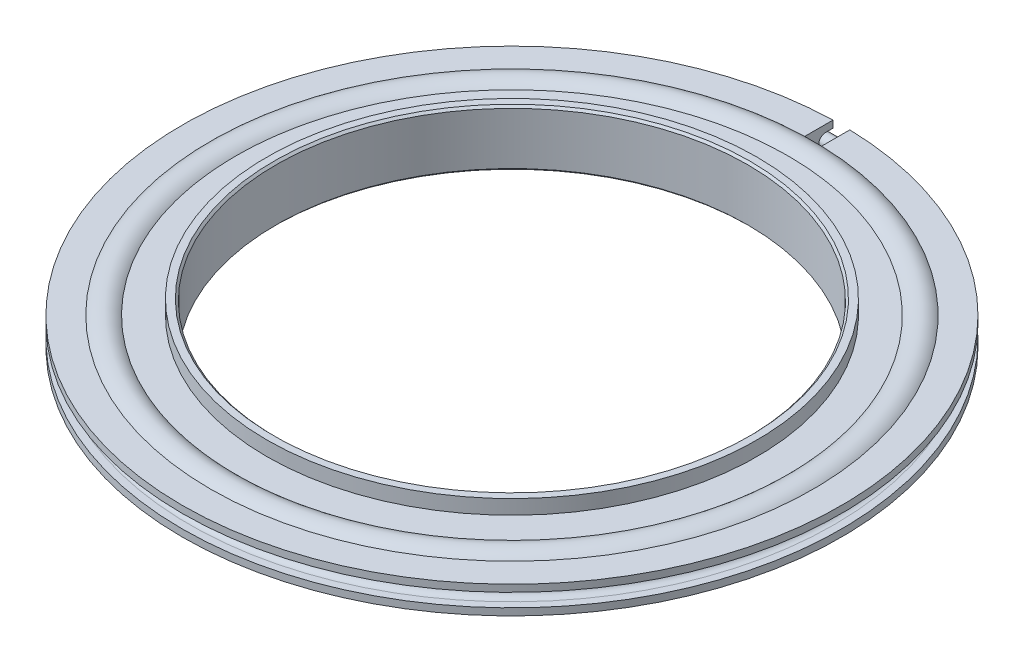
ISO-10303-21;
HEADER;
FILE_DESCRIPTION(('STEP AP214'),'2;1');
FILE_NAME('part.step','',(''),(''),'','','');
FILE_SCHEMA(('AUTOMOTIVE_DESIGN { 1 0 10303 214 1 1 1 1 }'));
ENDSEC;
DATA;
#1=APPLICATION_CONTEXT('core data for automotive mechanical design processes');
#2=APPLICATION_PROTOCOL_DEFINITION('international standard','automotive_design',2000,#1);
#3=PRODUCT_CONTEXT('',#1,'mechanical');
#4=PRODUCT('Part','Part','',(#3));
#5=PRODUCT_RELATED_PRODUCT_CATEGORY('part','',(#4));
#6=PRODUCT_DEFINITION_FORMATION('','',#4);
#7=PRODUCT_DEFINITION_CONTEXT('part definition',#1,'design');
#8=PRODUCT_DEFINITION('design','',#6,#7);
#9=PRODUCT_DEFINITION_SHAPE('','',#8);
#10=(LENGTH_UNIT() NAMED_UNIT(*) SI_UNIT(.MILLI.,.METRE.));
#11=(NAMED_UNIT(*) PLANE_ANGLE_UNIT() SI_UNIT($,.RADIAN.));
#12=(NAMED_UNIT(*) SI_UNIT($,.STERADIAN.) SOLID_ANGLE_UNIT());
#13=UNCERTAINTY_MEASURE_WITH_UNIT(LENGTH_MEASURE(1.E-05),#10,'distance_accuracy_value','');
#14=(GEOMETRIC_REPRESENTATION_CONTEXT(3) GLOBAL_UNCERTAINTY_ASSIGNED_CONTEXT((#13)) GLOBAL_UNIT_ASSIGNED_CONTEXT((#10,
#11,#12)) REPRESENTATION_CONTEXT('',''));
#15=CARTESIAN_POINT('',(0.,0.,0.));
#16=DIRECTION('',(0.,0.,1.));
#17=DIRECTION('',(1.,0.,0.));
#18=AXIS2_PLACEMENT_3D('',#15,#16,#17);
#19=CARTESIAN_POINT('',(0.,0.,0.));
#20=DIRECTION('',(0.,1.,0.));
#21=DIRECTION('',(0.,0.,1.));
#22=AXIS2_PLACEMENT_3D('',#19,#20,#21);
#23=TOROIDAL_SURFACE('',#22,45.75,0.700000000000014);
#24=CARTESIAN_POINT('',(11.0679267236848,0.,-44.3910294771269));
#25=DIRECTION('',(-0.970295726275997,0.,-0.241921895599668));
#26=DIRECTION('',(-0.241921895599668,0.,0.970295726275997));
#27=AXIS2_PLACEMENT_3D('',#24,#25,#26);
#28=CIRCLE('',#27,0.700000000000014);
#29=CARTESIAN_POINT('',(11.2372720506046,0.,-45.0702364855201));
#30=VERTEX_POINT('',#29);
#31=EDGE_CURVE('E70',#30,#30,#28,.T.);
#32=CARTESIAN_POINT('',(-11.0679267236848,0.,-44.3910294771268));
#33=DIRECTION('',(-0.970295726275996,0.,0.241921895599669));
#34=DIRECTION('',(0.241921895599669,0.,0.970295726275996));
#35=AXIS2_PLACEMENT_3D('',#32,#33,#34);
#36=CIRCLE('',#35,0.700000000000014);
#37=CARTESIAN_POINT('',(-11.2372720506046,0.,-45.0702364855201));
#38=VERTEX_POINT('',#37);
#39=EDGE_CURVE('E78',#38,#38,#36,.T.);
#40=CARTESIAN_POINT('',(0.,0.,0.));
#41=DIRECTION('',(0.,1.,0.));
#42=DIRECTION('',(0.,0.,1.));
#43=AXIS2_PLACEMENT_3D('',#40,#41,#42);
#44=CIRCLE('',#43,46.45);
#45=EDGE_CURVE('',#30,#38,#44,.T.);
#46=ORIENTED_EDGE('',*,*,#31,.F.);
#47=ORIENTED_EDGE('',*,*,#39,.T.);
#48=ORIENTED_EDGE('',*,*,#45,.T.);
#49=ORIENTED_EDGE('',*,*,#45,.F.);
#50=EDGE_LOOP('',(#46,#48,#47,#49));
#51=FACE_BOUND('',#50,.T.);
#52=ADVANCED_FACE('F63',(#51),#23,.F.);
#53=CARTESIAN_POINT('',(0.,0.,0.));
#54=DIRECTION('',(0.,1.,0.));
#55=DIRECTION('',(0.,0.,1.));
#56=AXIS2_PLACEMENT_3D('',#53,#54,#55);
#57=TOROIDAL_SURFACE('',#56,45.75,0.899999999999993);
#58=CARTESIAN_POINT('',(11.0679267236848,0.,-44.3910294771269));
#59=DIRECTION('',(-0.970295726275997,0.,-0.241921895599668));
#60=DIRECTION('',(-0.241921895599668,0.,0.970295726275997));
#61=AXIS2_PLACEMENT_3D('',#58,#59,#60);
#62=CIRCLE('',#61,0.899999999999993);
#63=CARTESIAN_POINT('',(11.2856564297245,0.,-45.2642956307753));
#64=VERTEX_POINT('',#63);
#65=EDGE_CURVE('E11',#64,#64,#62,.T.);
#66=CARTESIAN_POINT('',(-11.0679267236848,0.,-44.3910294771268));
#67=DIRECTION('',(-0.970295726275996,0.,0.241921895599669));
#68=DIRECTION('',(0.241921895599669,0.,0.970295726275996));
#69=AXIS2_PLACEMENT_3D('',#66,#67,#68);
#70=CIRCLE('',#69,0.899999999999993);
#71=CARTESIAN_POINT('',(-11.2856564297245,0.,-45.2642956307752));
#72=VERTEX_POINT('',#71);
#73=EDGE_CURVE('E74',#72,#72,#70,.T.);
#74=CARTESIAN_POINT('',(0.,0.,0.));
#75=DIRECTION('',(0.,1.,0.));
#76=DIRECTION('',(0.,0.,1.));
#77=AXIS2_PLACEMENT_3D('',#74,#75,#76);
#78=CIRCLE('',#77,46.65);
#79=EDGE_CURVE('',#64,#72,#78,.T.);
#80=ORIENTED_EDGE('',*,*,#65,.T.);
#81=ORIENTED_EDGE('',*,*,#73,.F.);
#82=ORIENTED_EDGE('',*,*,#79,.T.);
#83=ORIENTED_EDGE('',*,*,#79,.F.);
#84=EDGE_LOOP('',(#80,#82,#81,#83));
#85=FACE_BOUND('',#84,.T.);
#86=ADVANCED_FACE('F65',(#85),#57,.T.);
#87=CARTESIAN_POINT('',(11.0679267236848,0.,-44.3910294771269));
#88=DIRECTION('',(-0.970295726275997,0.,-0.241921895599668));
#89=DIRECTION('',(-0.241921895599668,0.,0.970295726275997));
#90=AXIS2_PLACEMENT_3D('',#87,#88,#89);
#91=PLANE('',#90);
#92=ORIENTED_EDGE('',*,*,#31,.T.);
#93=EDGE_LOOP('',(#92));
#94=FACE_BOUND('',#93,.T.);
#95=ORIENTED_EDGE('',*,*,#65,.F.);
#96=EDGE_LOOP('',(#95));
#97=FACE_BOUND('',#96,.T.);
#98=ADVANCED_FACE('F88',(#94,#97),#91,.F.);
#99=CARTESIAN_POINT('',(-11.0679267236848,0.,-44.3910294771268));
#100=DIRECTION('',(-0.970295726275996,0.,0.241921895599669));
#101=DIRECTION('',(0.241921895599669,0.,0.970295726275996));
#102=AXIS2_PLACEMENT_3D('',#99,#100,#101);
#103=PLANE('',#102);
#104=ORIENTED_EDGE('',*,*,#39,.F.);
#105=EDGE_LOOP('',(#104));
#106=FACE_BOUND('',#105,.T.);
#107=ORIENTED_EDGE('',*,*,#73,.T.);
#108=EDGE_LOOP('',(#107));
#109=FACE_BOUND('',#108,.T.);
#110=ADVANCED_FACE('F85',(#106,#109),#103,.T.);
#111=CLOSED_SHELL('',(#52,#86,#98,#110));
#112=MANIFOLD_SOLID_BREP('B2',#111);
#113=CARTESIAN_POINT('',(0.,11.9009557377661,0.));
#114=DIRECTION('',(0.,1.,0.));
#115=DIRECTION('',(0.,0.,1.));
#116=AXIS2_PLACEMENT_3D('',#113,#114,#115);
#117=CYLINDRICAL_SURFACE('',#116,46.8);
#118=DIRECTION('',(0.,-1.,0.));
#119=VECTOR('',#118,1.);
#120=CARTESIAN_POINT('',(1.2,11.9009557377661,-46.784612855083));
#121=LINE('',#120,#119);
#122=CARTESIAN_POINT('',(1.2,-0.95,-46.784612855083));
#123=VERTEX_POINT('',#122);
#124=CARTESIAN_POINT('',(1.2,-1.95,-46.784612855083));
#125=VERTEX_POINT('',#124);
#126=EDGE_CURVE('E244',#123,#125,#121,.T.);
#127=ORIENTED_EDGE('',*,*,#126,.F.);
#128=CARTESIAN_POINT('',(0.,-0.95,0.));
#129=DIRECTION('',(0.,1.,0.));
#130=DIRECTION('',(0.,0.,1.));
#131=AXIS2_PLACEMENT_3D('',#128,#129,#130);
#132=CIRCLE('',#131,46.8);
#133=CARTESIAN_POINT('',(-1.2,-0.95,-46.784612855083));
#134=VERTEX_POINT('',#133);
#135=EDGE_CURVE('E228',#134,#123,#132,.T.);
#136=ORIENTED_EDGE('',*,*,#135,.F.);
#137=DIRECTION('',(0.,1.,0.));
#138=VECTOR('',#137,1.);
#139=CARTESIAN_POINT('',(-1.2,11.9009557377661,-46.784612855083));
#140=LINE('',#139,#138);
#141=CARTESIAN_POINT('',(-1.2,-1.95,-46.784612855083));
#142=VERTEX_POINT('',#141);
#143=EDGE_CURVE('E290',#142,#134,#140,.T.);
#144=ORIENTED_EDGE('',*,*,#143,.F.);
#145=CARTESIAN_POINT('',(0.,-1.95,0.));
#146=DIRECTION('',(0.,1.,0.));
#147=DIRECTION('',(0.,0.,1.));
#148=AXIS2_PLACEMENT_3D('',#145,#146,#147);
#149=CIRCLE('',#148,46.8);
#150=EDGE_CURVE('E146',#142,#125,#149,.T.);
#151=ORIENTED_EDGE('',*,*,#150,.T.);
#152=EDGE_LOOP('',(#127,#136,#144,#151));
#153=FACE_BOUND('',#152,.T.);
#154=ADVANCED_FACE('F135',(#153),#117,.T.);
#155=CARTESIAN_POINT('',(-1.2,0.95,-46.784612855083));
#156=VERTEX_POINT('',#155);
#157=CARTESIAN_POINT('',(-1.2,1.95,-46.784612855083));
#158=VERTEX_POINT('',#157);
#159=EDGE_CURVE('E262',#156,#158,#140,.T.);
#160=ORIENTED_EDGE('',*,*,#159,.F.);
#161=CARTESIAN_POINT('',(0.,0.95,0.));
#162=DIRECTION('',(0.,1.,0.));
#163=DIRECTION('',(0.,0.,1.));
#164=AXIS2_PLACEMENT_3D('',#161,#162,#163);
#165=CIRCLE('',#164,46.8);
#166=CARTESIAN_POINT('',(1.2,0.95,-46.784612855083));
#167=VERTEX_POINT('',#166);
#168=EDGE_CURVE('E240',#156,#167,#165,.T.);
#169=ORIENTED_EDGE('',*,*,#168,.T.);
#170=CARTESIAN_POINT('',(1.2,1.95,-46.784612855083));
#171=VERTEX_POINT('',#170);
#172=EDGE_CURVE('E253',#171,#167,#121,.T.);
#173=ORIENTED_EDGE('',*,*,#172,.F.);
#174=CARTESIAN_POINT('',(0.,1.95,0.));
#175=DIRECTION('',(0.,1.,0.));
#176=DIRECTION('',(0.,0.,1.));
#177=AXIS2_PLACEMENT_3D('',#174,#175,#176);
#178=CIRCLE('',#177,46.8);
#179=EDGE_CURVE('E294',#158,#171,#178,.T.);
#180=ORIENTED_EDGE('',*,*,#179,.F.);
#181=EDGE_LOOP('',(#160,#169,#173,#180));
#182=FACE_BOUND('',#181,.T.);
#183=ADVANCED_FACE('F435',(#182),#117,.T.);
#184=CARTESIAN_POINT('',(-1.2,-4.,-49.));
#185=DIRECTION('',(-1.,0.,0.));
#186=DIRECTION('',(0.,1.,0.));
#187=AXIS2_PLACEMENT_3D('',#184,#185,#186);
#188=PLANE('',#187);
#189=DIRECTION('',(0.,0.,1.));
#190=VECTOR('',#189,1.);
#191=CARTESIAN_POINT('',(-1.2,-0.95,0.));
#192=LINE('',#191,#190);
#193=CARTESIAN_POINT('',(-1.2,-0.950000000000003,-45.7342595873159));
#194=VERTEX_POINT('',#193);
#195=EDGE_CURVE('E235',#134,#194,#192,.T.);
#196=ORIENTED_EDGE('',*,*,#195,.T.);
#197=CARTESIAN_POINT('',(-1.2,-0.950000000000007,-45.7342595873159));
#198=CARTESIAN_POINT('',(-1.2,-0.95004532600479,-45.6807835862706));
#199=CARTESIAN_POINT('',(-1.2,-0.94549052715475,-45.6273210432147));
#200=CARTESIAN_POINT('',(-1.2,-0.927514539490264,-45.5219452192249));
#201=CARTESIAN_POINT('',(-1.2,-0.914099687078438,-45.4700308587953));
#202=CARTESIAN_POINT('',(-1.2,-0.878727986361987,-45.3691686045336));
#203=CARTESIAN_POINT('',(-1.2,-0.856766991021886,-45.3202221642397));
#204=CARTESIAN_POINT('',(-1.2,-0.804946348114225,-45.2267227979042));
#205=CARTESIAN_POINT('',(-1.2,-0.775088624932405,-45.1821688050756));
#206=CARTESIAN_POINT('',(-1.2,-0.7083225603589,-45.098716419276));
#207=CARTESIAN_POINT('',(-1.2,-0.671415758236421,-45.059816794851));
#208=CARTESIAN_POINT('',(-1.2,-0.591577938839479,-44.9887531068965));
#209=CARTESIAN_POINT('',(-1.2,-0.548644628954462,-44.9565916183562));
#210=CARTESIAN_POINT('',(-1.2,-0.457987119674033,-44.8999373842834));
#211=CARTESIAN_POINT('',(-1.2,-0.410262626271292,-44.8754451097467));
#212=CARTESIAN_POINT('',(-1.2,-0.311415541954127,-44.8348507871987));
#213=CARTESIAN_POINT('',(-1.2,-0.260296990682501,-44.8187389596194));
#214=CARTESIAN_POINT('',(-1.2,-0.174078292860573,-44.7993594450218));
#215=CARTESIAN_POINT('',(-1.2,-0.139521979857928,-44.7935795250112));
#216=CARTESIAN_POINT('',(-1.2,-0.0699822005703651,-44.7858618592694));
#217=CARTESIAN_POINT('',(-1.2,-0.0349987254445299,-44.7839241931969));
#218=CARTESIAN_POINT('',(-1.2,0.0533527233941154,-44.7839279659086));
#219=CARTESIAN_POINT('',(-1.2,0.106740886293251,-44.7884365690029));
#220=CARTESIAN_POINT('',(-1.2,0.212042086703368,-44.8063581543426));
#221=CARTESIAN_POINT('',(-1.2,0.263953453231335,-44.8197808351372));
#222=CARTESIAN_POINT('',(-1.2,0.364766337291553,-44.8551472781141));
#223=CARTESIAN_POINT('',(-1.2,0.413669191040537,-44.8770872252742));
#224=CARTESIAN_POINT('',(-1.2,0.50708653924883,-44.9288599169522));
#225=CARTESIAN_POINT('',(-1.2,0.551601946804269,-44.9586910144175));
#226=CARTESIAN_POINT('',(-1.2,0.635005283169229,-45.0254076486237));
#227=CARTESIAN_POINT('',(-1.2,0.673891925040134,-45.0622947941702));
#228=CARTESIAN_POINT('',(-1.2,0.744926017599645,-45.1420762504091));
#229=CARTESIAN_POINT('',(-1.2,0.777072944081856,-45.184971027935));
#230=CARTESIAN_POINT('',(-1.2,0.833728334346094,-45.2755669762987));
#231=CARTESIAN_POINT('',(-1.2,0.858232536228403,-45.3232708093167));
#232=CARTESIAN_POINT('',(-1.2,0.898876289603548,-45.4221085361315));
#233=CARTESIAN_POINT('',(-1.2,0.915020109926445,-45.4732406643385));
#234=CARTESIAN_POINT('',(-1.2,0.934482097379196,-45.5596144137322));
#235=CARTESIAN_POINT('',(-1.2,0.940298029123203,-45.5943138452588));
#236=CARTESIAN_POINT('',(-1.2,0.94805634106175,-45.6640905655517));
#237=CARTESIAN_POINT('',(-1.2,0.950004484223843,-45.6991672137394));
#238=CARTESIAN_POINT('',(-1.2,0.949999999999993,-45.734259587316));
#239=B_SPLINE_CURVE_WITH_KNOTS('',3,(#197,#198,#199,#200,#201,#202,#203,#204,#205,#206,#207,
#208,#209,#210,#211,#212,#213,#214,#215,#216,#217,#218,#219,#220,#221,#222,#223,#224,#225,#226,
#227,#228,#229,#230,#231,#232,#233,#234,#235,#236,#237,#238),.UNSPECIFIED.,.F.,.F.,(4,2,2,2,2,2,
2,2,2,2,2,2,2,2,2,2,2,2,2,2,4),(0.,0.160215119802201,0.320315783204715,0.480494232891471,
0.640633683949617,0.800738206119776,0.960903801328819,1.12107923099227,1.281067322095,
1.38597777003601,1.49089039298747,1.6508211928034,1.81092628361351,1.97095974333991,
2.1309598269621,2.29099643477988,2.45104548542516,2.61118362713326,2.77123992111736,
2.8765894813946,2.98178195368969),.UNSPECIFIED.);
#240=CARTESIAN_POINT('',(-1.2,0.949999999999997,-45.734259587316));
#241=VERTEX_POINT('',#240);
#242=EDGE_CURVE('E617',#194,#241,#239,.T.);
#243=ORIENTED_EDGE('',*,*,#242,.T.);
#244=DIRECTION('',(0.,0.,-1.));
#245=VECTOR('',#244,1.);
#246=CARTESIAN_POINT('',(-1.2,0.95,0.));
#247=LINE('',#246,#245);
#248=EDGE_CURVE('E641',#241,#156,#247,.T.);
#249=ORIENTED_EDGE('',*,*,#248,.T.);
#250=ORIENTED_EDGE('',*,*,#159,.T.);
#251=DIRECTION('',(0.,0.,1.));
#252=VECTOR('',#251,1.);
#253=CARTESIAN_POINT('',(-1.2,1.95,-49.));
#254=LINE('',#253,#252);
#255=CARTESIAN_POINT('',(-1.2,1.95,-42.7776079187277));
#256=VERTEX_POINT('',#255);
#257=EDGE_CURVE('E804',#158,#256,#254,.T.);
#258=ORIENTED_EDGE('',*,*,#257,.T.);
#259=CARTESIAN_POINT('',(-1.2,1.95,-42.7776079187277));
#260=CARTESIAN_POINT('',(-1.2,1.57436043520277,-43.1859732021887));
#261=CARTESIAN_POINT('',(-1.2,1.06603604318218,-43.4095387854252));
#262=CARTESIAN_POINT('',(-1.2,0.814604393185881,-43.5201206586501));
#263=CARTESIAN_POINT('',(-1.2,0.544765051912349,-43.5768820507387));
#264=CARTESIAN_POINT('',(-1.2,0.277153302258735,-43.6331748632615));
#265=CARTESIAN_POINT('',(-1.2,0.00261457486158516,-43.6335007465527));
#266=CARTESIAN_POINT('',(-1.2,-0.27229770194486,-43.633827073255));
#267=CARTESIAN_POINT('',(-1.2,-0.5424537820909,-43.5773666602289));
#268=CARTESIAN_POINT('',(-1.2,-0.81053765495165,-43.5213393215913));
#269=CARTESIAN_POINT('',(-1.2,-1.06244663176316,-43.4111134054443));
#270=CARTESIAN_POINT('',(-1.2,-1.31408733417394,-43.3010048761089));
#271=CARTESIAN_POINT('',(-1.2,-1.54039642617078,-43.1393173490104));
#272=CARTESIAN_POINT('',(-1.2,-1.76466935972214,-42.9790845642774));
#273=CARTESIAN_POINT('',(-1.2,-1.95,-42.7776079187277));
#274=B_SPLINE_CURVE_WITH_KNOTS('',2,(#259,#260,#261,#262,#263,#264,#265,#266,#267,#268,#269,
#270,#271,#272,#273),.UNSPECIFIED.,.F.,.F.,(3,2,2,2,2,2,2,3),(0.,0.25,0.375,0.5,0.625,0.75,
0.875,1.),.UNSPECIFIED.);
#275=CARTESIAN_POINT('',(-1.2,-1.95,-42.7776079187277));
#276=VERTEX_POINT('',#275);
#277=EDGE_CURVE('E852',#256,#276,#274,.T.);
#278=ORIENTED_EDGE('',*,*,#277,.T.);
#279=DIRECTION('',(0.,0.,-1.));
#280=VECTOR('',#279,1.);
#281=CARTESIAN_POINT('',(-1.2,-1.95,0.));
#282=LINE('',#281,#280);
#283=EDGE_CURVE('E293',#276,#142,#282,.T.);
#284=ORIENTED_EDGE('',*,*,#283,.T.);
#285=ORIENTED_EDGE('',*,*,#143,.T.);
#286=EDGE_LOOP('',(#196,#243,#249,#250,#258,#278,#284,#285));
#287=FACE_BOUND('',#286,.T.);
#288=ADVANCED_FACE('F426',(#287),#188,.F.);
#289=CARTESIAN_POINT('',(1.2,-4.,-41.));
#290=DIRECTION('',(1.,0.,0.));
#291=DIRECTION('',(0.,1.,0.));
#292=AXIS2_PLACEMENT_3D('',#289,#290,#291);
#293=PLANE('',#292);
#294=DIRECTION('',(0.,0.,-1.));
#295=VECTOR('',#294,1.);
#296=CARTESIAN_POINT('',(1.2,-0.95,0.));
#297=LINE('',#296,#295);
#298=CARTESIAN_POINT('',(1.2,-0.950000000000003,-45.7342595873159));
#299=VERTEX_POINT('',#298);
#300=EDGE_CURVE('E232',#299,#123,#297,.T.);
#301=ORIENTED_EDGE('',*,*,#300,.T.);
#302=ORIENTED_EDGE('',*,*,#126,.T.);
#303=DIRECTION('',(0.,0.,1.));
#304=VECTOR('',#303,1.);
#305=CARTESIAN_POINT('',(1.2,-1.95,0.));
#306=LINE('',#305,#304);
#307=CARTESIAN_POINT('',(1.2,-1.95,-42.7776079187277));
#308=VERTEX_POINT('',#307);
#309=EDGE_CURVE('E254',#125,#308,#306,.T.);
#310=ORIENTED_EDGE('',*,*,#309,.T.);
#311=CARTESIAN_POINT('',(1.2,-1.95,-42.7776079187277));
#312=CARTESIAN_POINT('',(1.2,-1.76389574184956,-42.9799255797386));
#313=CARTESIAN_POINT('',(1.2,-1.53821197448114,-43.1409472840219));
#314=CARTESIAN_POINT('',(1.2,-1.31443617285279,-43.3006076857234));
#315=CARTESIAN_POINT('',(1.2,-1.06343934910663,-43.4106785488575));
#316=CARTESIAN_POINT('',(1.2,-0.811743114065295,-43.5210561282432));
#317=CARTESIAN_POINT('',(1.2,-0.54166920908929,-43.5775306746101));
#318=CARTESIAN_POINT('',(1.2,-0.274062480586535,-43.633489315258));
#319=CARTESIAN_POINT('',(1.2,0.000410992786804322,-43.6335020049696));
#320=CARTESIAN_POINT('',(1.2,0.27496086441584,-43.6335146982132));
#321=CARTESIAN_POINT('',(1.2,0.544711711885889,-43.5768932589193));
#322=CARTESIAN_POINT('',(1.2,0.81326774892559,-43.5205226135965));
#323=CARTESIAN_POINT('',(1.2,1.06552881095845,-43.4097616847313));
#324=CARTESIAN_POINT('',(1.2,1.31593223978965,-43.2998163917683));
#325=CARTESIAN_POINT('',(1.2,1.53942495736358,-43.140318556824));
#326=CARTESIAN_POINT('',(1.2,1.76336788112945,-42.9804994276843));
#327=CARTESIAN_POINT('',(1.2,1.95,-42.7776079187277));
#328=B_SPLINE_CURVE_WITH_KNOTS('',2,(#311,#312,#313,#314,#315,#316,#317,#318,#319,#320,#321,
#322,#323,#324,#325,#326,#327),.UNSPECIFIED.,.F.,.F.,(3,2,2,2,2,2,2,2,3),(0.,0.125,0.25,0.375,
0.5,0.625,0.75,0.875,1.),.UNSPECIFIED.);
#329=CARTESIAN_POINT('',(1.2,1.95,-42.7776079187277));
#330=VERTEX_POINT('',#329);
#331=EDGE_CURVE('E170',#308,#330,#328,.T.);
#332=ORIENTED_EDGE('',*,*,#331,.T.);
#333=DIRECTION('',(0.,0.,-1.));
#334=VECTOR('',#333,1.);
#335=CARTESIAN_POINT('',(1.2,1.95,-41.));
#336=LINE('',#335,#334);
#337=EDGE_CURVE('E340',#330,#171,#336,.T.);
#338=ORIENTED_EDGE('',*,*,#337,.T.);
#339=ORIENTED_EDGE('',*,*,#172,.T.);
#340=DIRECTION('',(0.,0.,1.));
#341=VECTOR('',#340,1.);
#342=CARTESIAN_POINT('',(1.2,0.95,0.));
#343=LINE('',#342,#341);
#344=CARTESIAN_POINT('',(1.2,0.95,-45.7342595873159));
#345=VERTEX_POINT('',#344);
#346=EDGE_CURVE('E666',#167,#345,#343,.T.);
#347=ORIENTED_EDGE('',*,*,#346,.T.);
#348=CARTESIAN_POINT('',(1.2,0.949999999999993,-45.7342595873159));
#349=CARTESIAN_POINT('',(1.2,0.950045326004777,-45.6807835862706));
#350=CARTESIAN_POINT('',(1.2,0.945490527154737,-45.6273210432147));
#351=CARTESIAN_POINT('',(1.2,0.927514539490251,-45.5219452192249));
#352=CARTESIAN_POINT('',(1.2,0.914099687078424,-45.4700308587953));
#353=CARTESIAN_POINT('',(1.2,0.878727986361974,-45.3691686045336));
#354=CARTESIAN_POINT('',(1.2,0.856766991021872,-45.3202221642397));
#355=CARTESIAN_POINT('',(1.2,0.804946348114212,-45.2267227979042));
#356=CARTESIAN_POINT('',(1.2,0.775088624932392,-45.1821688050756));
#357=CARTESIAN_POINT('',(1.2,0.708322560358887,-45.098716419276));
#358=CARTESIAN_POINT('',(1.2,0.671415758236408,-45.059816794851));
#359=CARTESIAN_POINT('',(1.2,0.591577938839466,-44.9887531068965));
#360=CARTESIAN_POINT('',(1.2,0.548644628954449,-44.9565916183562));
#361=CARTESIAN_POINT('',(1.2,0.45798711967402,-44.8999373842834));
#362=CARTESIAN_POINT('',(1.2,0.410262626271278,-44.8754451097467));
#363=CARTESIAN_POINT('',(1.2,0.311415541954114,-44.8348507871987));
#364=CARTESIAN_POINT('',(1.2,0.260296990682488,-44.8187389596194));
#365=CARTESIAN_POINT('',(1.2,0.17407829286056,-44.7993594450218));
#366=CARTESIAN_POINT('',(1.2,0.139521979857915,-44.7935795250112));
#367=CARTESIAN_POINT('',(1.2,0.0699822005703516,-44.7858618592694));
#368=CARTESIAN_POINT('',(1.2,0.0349987254445165,-44.7839241931969));
#369=CARTESIAN_POINT('',(1.2,-0.0533527233941298,-44.7839279659086));
#370=CARTESIAN_POINT('',(1.2,-0.106740886293267,-44.7884365690029));
#371=CARTESIAN_POINT('',(1.2,-0.212042086703383,-44.8063581543426));
#372=CARTESIAN_POINT('',(1.2,-0.263953453231349,-44.8197808351372));
#373=CARTESIAN_POINT('',(1.2,-0.364766337291566,-44.8551472781141));
#374=CARTESIAN_POINT('',(1.2,-0.413669191040551,-44.8770872252742));
#375=CARTESIAN_POINT('',(1.2,-0.507086539248843,-44.9288599169522));
#376=CARTESIAN_POINT('',(1.2,-0.551601946804283,-44.9586910144175));
#377=CARTESIAN_POINT('',(1.2,-0.635005283169243,-45.0254076486237));
#378=CARTESIAN_POINT('',(1.2,-0.673891925040147,-45.0622947941702));
#379=CARTESIAN_POINT('',(1.2,-0.744926017599658,-45.1420762504091));
#380=CARTESIAN_POINT('',(1.2,-0.77707294408187,-45.184971027935));
#381=CARTESIAN_POINT('',(1.2,-0.833728334346107,-45.2755669762987));
#382=CARTESIAN_POINT('',(1.2,-0.858232536228417,-45.3232708093167));
#383=CARTESIAN_POINT('',(1.2,-0.898876289603561,-45.4221085361315));
#384=CARTESIAN_POINT('',(1.2,-0.915020109926458,-45.4732406643385));
#385=CARTESIAN_POINT('',(1.2,-0.934482097379206,-45.5596144137322));
#386=CARTESIAN_POINT('',(1.2,-0.940298029123211,-45.5943138452588));
#387=CARTESIAN_POINT('',(1.2,-0.948056341061758,-45.6640905655517));
#388=CARTESIAN_POINT('',(1.2,-0.950004484223852,-45.6991672137393));
#389=CARTESIAN_POINT('',(1.2,-0.950000000000007,-45.7342595873159));
#390=B_SPLINE_CURVE_WITH_KNOTS('',3,(#348,#349,#350,#351,#352,#353,#354,#355,#356,#357,#358,
#359,#360,#361,#362,#363,#364,#365,#366,#367,#368,#369,#370,#371,#372,#373,#374,#375,#376,#377,
#378,#379,#380,#381,#382,#383,#384,#385,#386,#387,#388,#389),.UNSPECIFIED.,.F.,.F.,(4,2,2,2,2,2,
2,2,2,2,2,2,2,2,2,2,2,2,2,2,4),(0.,0.160215119802201,0.320315783204715,0.480494232891471,
0.640633683949617,0.800738206119776,0.960903801328819,1.12107923099227,1.281067322095,
1.38597777003601,1.49089039298747,1.6508211928034,1.81092628361351,1.97095974333992,
2.1309598269621,2.29099643477988,2.45104548542516,2.61118362713326,2.77123992111737,
2.87658948139455,2.98178195368959),.UNSPECIFIED.);
#391=EDGE_CURVE('E247',#345,#299,#390,.T.);
#392=ORIENTED_EDGE('',*,*,#391,.T.);
#393=EDGE_LOOP('',(#301,#302,#310,#332,#338,#339,#347,#392));
#394=FACE_BOUND('',#393,.T.);
#395=ADVANCED_FACE('F243',(#394),#293,.F.);
#396=CARTESIAN_POINT('',(0.,0.,0.));
#397=DIRECTION('',(0.,1.,0.));
#398=DIRECTION('',(0.,0.,1.));
#399=AXIS2_PLACEMENT_3D('',#396,#397,#398);
#400=TOROIDAL_SURFACE('',#399,41.,2.65);
#401=CARTESIAN_POINT('',(0.,-1.95,0.));
#402=DIRECTION('',(0.,1.,0.));
#403=DIRECTION('',(0.,0.,1.));
#404=AXIS2_PLACEMENT_3D('',#401,#402,#403);
#405=CIRCLE('',#404,42.7944358444927);
#406=EDGE_CURVE('E306',#276,#308,#405,.T.);
#407=ORIENTED_EDGE('',*,*,#406,.F.);
#408=ORIENTED_EDGE('',*,*,#277,.F.);
#409=CARTESIAN_POINT('',(0.,1.95,0.));
#410=DIRECTION('',(0.,1.,0.));
#411=DIRECTION('',(0.,0.,1.));
#412=AXIS2_PLACEMENT_3D('',#409,#410,#411);
#413=CIRCLE('',#412,42.7944358444927);
#414=EDGE_CURVE('E61',#256,#330,#413,.T.);
#415=ORIENTED_EDGE('',*,*,#414,.T.);
#416=ORIENTED_EDGE('',*,*,#331,.F.);
#417=EDGE_LOOP('',(#407,#408,#415,#416));
#418=FACE_BOUND('',#417,.T.);
#419=ADVANCED_FACE('F439',(#418),#400,.F.);
#420=CARTESIAN_POINT('',(-46.8,1.95,0.));
#421=DIRECTION('',(0.,1.,0.));
#422=DIRECTION('',(1.,0.,0.));
#423=AXIS2_PLACEMENT_3D('',#420,#421,#422);
#424=PLANE('',#423);
#425=ORIENTED_EDGE('',*,*,#337,.F.);
#426=ORIENTED_EDGE('',*,*,#414,.F.);
#427=ORIENTED_EDGE('',*,*,#257,.F.);
#428=ORIENTED_EDGE('',*,*,#179,.T.);
#429=EDGE_LOOP('',(#425,#426,#427,#428));
#430=FACE_BOUND('',#429,.T.);
#431=ADVANCED_FACE('F509',(#430),#424,.T.);
#432=CARTESIAN_POINT('',(-46.8,-1.95,0.));
#433=DIRECTION('',(0.,-1.,0.));
#434=DIRECTION('',(0.,0.,-1.));
#435=AXIS2_PLACEMENT_3D('',#432,#433,#434);
#436=PLANE('',#435);
#437=ORIENTED_EDGE('',*,*,#309,.F.);
#438=ORIENTED_EDGE('',*,*,#150,.F.);
#439=ORIENTED_EDGE('',*,*,#283,.F.);
#440=ORIENTED_EDGE('',*,*,#406,.T.);
#441=EDGE_LOOP('',(#437,#438,#439,#440));
#442=FACE_BOUND('',#441,.T.);
#443=ADVANCED_FACE('F437',(#442),#436,.T.);
#444=CARTESIAN_POINT('',(-45.75,-0.95,0.));
#445=DIRECTION('',(0.,1.,0.));
#446=DIRECTION('',(1.,0.,0.));
#447=AXIS2_PLACEMENT_3D('',#444,#445,#446);
#448=PLANE('',#447);
#449=ORIENTED_EDGE('',*,*,#300,.F.);
#450=CARTESIAN_POINT('',(0.,-0.95,0.));
#451=DIRECTION('',(0.,1.,0.));
#452=DIRECTION('',(0.,0.,1.));
#453=AXIS2_PLACEMENT_3D('',#450,#451,#452);
#454=CIRCLE('',#453,45.75);
#455=EDGE_CURVE('E623',#194,#299,#454,.T.);
#456=ORIENTED_EDGE('',*,*,#455,.F.);
#457=ORIENTED_EDGE('',*,*,#195,.F.);
#458=ORIENTED_EDGE('',*,*,#135,.T.);
#459=EDGE_LOOP('',(#449,#456,#457,#458));
#460=FACE_BOUND('',#459,.T.);
#461=ADVANCED_FACE('F230',(#460),#448,.T.);
#462=CARTESIAN_POINT('',(0.,0.,0.));
#463=DIRECTION('',(0.,1.,0.));
#464=DIRECTION('',(0.,0.,1.));
#465=AXIS2_PLACEMENT_3D('',#462,#463,#464);
#466=TOROIDAL_SURFACE('',#465,45.75,0.95);
#467=ORIENTED_EDGE('',*,*,#455,.T.);
#468=ORIENTED_EDGE('',*,*,#391,.F.);
#469=CARTESIAN_POINT('',(0.,0.95,0.));
#470=DIRECTION('',(0.,1.,0.));
#471=DIRECTION('',(0.,0.,1.));
#472=AXIS2_PLACEMENT_3D('',#469,#470,#471);
#473=CIRCLE('',#472,45.75);
#474=EDGE_CURVE('E157',#241,#345,#473,.T.);
#475=ORIENTED_EDGE('',*,*,#474,.F.);
#476=ORIENTED_EDGE('',*,*,#242,.F.);
#477=EDGE_LOOP('',(#467,#468,#475,#476));
#478=FACE_BOUND('',#477,.T.);
#479=ADVANCED_FACE('F702',(#478),#466,.F.);
#480=CARTESIAN_POINT('',(-46.8,0.95,0.));
#481=DIRECTION('',(0.,-1.,0.));
#482=DIRECTION('',(0.,0.,-1.));
#483=AXIS2_PLACEMENT_3D('',#480,#481,#482);
#484=PLANE('',#483);
#485=ORIENTED_EDGE('',*,*,#346,.F.);
#486=ORIENTED_EDGE('',*,*,#168,.F.);
#487=ORIENTED_EDGE('',*,*,#248,.F.);
#488=ORIENTED_EDGE('',*,*,#474,.T.);
#489=EDGE_LOOP('',(#485,#486,#487,#488));
#490=FACE_BOUND('',#489,.T.);
#491=ADVANCED_FACE('F516',(#490),#484,.T.);
#492=CLOSED_SHELL('',(#154,#183,#288,#395,#419,#431,#443,#461,#479,#491));
#493=MANIFOLD_SOLID_BREP('B6',#492);
#494=CARTESIAN_POINT('',(0.,0.,0.));
#495=DIRECTION('',(0.,-1.,0.));
#496=DIRECTION('',(0.,0.,-1.));
#497=AXIS2_PLACEMENT_3D('',#494,#495,#496);
#498=TOROIDAL_SURFACE('',#497,41.,2.65000000000001);
#499=CARTESIAN_POINT('',(0.,1.95,0.));
#500=DIRECTION('',(0.,-1.,0.));
#501=DIRECTION('',(0.,0.,-1.));
#502=AXIS2_PLACEMENT_3D('',#499,#500,#501);
#503=CIRCLE('',#502,39.2055641555073);
#504=CARTESIAN_POINT('',(0.,1.95,-39.2055641555073));
#505=VERTEX_POINT('',#504);
#506=EDGE_CURVE('E1163',#505,#505,#503,.T.);
#507=ORIENTED_EDGE('',*,*,#506,.T.);
#508=EDGE_LOOP('',(#507));
#509=FACE_BOUND('',#508,.T.);
#510=CARTESIAN_POINT('',(0.,-1.95,0.));
#511=DIRECTION('',(0.,-1.,0.));
#512=DIRECTION('',(0.,0.,-1.));
#513=AXIS2_PLACEMENT_3D('',#510,#511,#512);
#514=CIRCLE('',#513,39.2055641555073);
#515=CARTESIAN_POINT('',(0.,-1.95,-39.2055641555073));
#516=VERTEX_POINT('',#515);
#517=EDGE_CURVE('E134',#516,#516,#514,.T.);
#518=ORIENTED_EDGE('',*,*,#517,.F.);
#519=EDGE_LOOP('',(#518));
#520=FACE_BOUND('',#519,.T.);
#521=ADVANCED_FACE('F1129',(#509,#520),#498,.F.);
#522=CARTESIAN_POINT('',(34.8,-1.95,0.));
#523=DIRECTION('',(0.,-1.,0.));
#524=DIRECTION('',(0.,0.,-1.));
#525=AXIS2_PLACEMENT_3D('',#522,#523,#524);
#526=PLANE('',#525);
#527=ORIENTED_EDGE('',*,*,#517,.T.);
#528=EDGE_LOOP('',(#527));
#529=FACE_BOUND('',#528,.T.);
#530=CARTESIAN_POINT('',(0.,-1.95,0.));
#531=DIRECTION('',(0.,-1.,0.));
#532=DIRECTION('',(0.,0.,-1.));
#533=AXIS2_PLACEMENT_3D('',#530,#531,#532);
#534=CIRCLE('',#533,34.8);
#535=CARTESIAN_POINT('',(0.,-1.95,-34.8));
#536=VERTEX_POINT('',#535);
#537=EDGE_CURVE('E1135',#536,#536,#534,.T.);
#538=ORIENTED_EDGE('',*,*,#537,.F.);
#539=EDGE_LOOP('',(#538));
#540=FACE_BOUND('',#539,.T.);
#541=ADVANCED_FACE('F1181',(#529,#540),#526,.T.);
#542=CARTESIAN_POINT('',(0.,4.,0.));
#543=DIRECTION('',(0.,-1.,0.));
#544=DIRECTION('',(0.,0.,-1.));
#545=AXIS2_PLACEMENT_3D('',#542,#543,#544);
#546=CYLINDRICAL_SURFACE('',#545,34.8);
#547=ORIENTED_EDGE('',*,*,#537,.T.);
#548=EDGE_LOOP('',(#547));
#549=FACE_BOUND('',#548,.T.);
#550=CARTESIAN_POINT('',(0.,-4.,0.));
#551=DIRECTION('',(0.,-1.,0.));
#552=DIRECTION('',(0.,0.,-1.));
#553=AXIS2_PLACEMENT_3D('',#550,#551,#552);
#554=CIRCLE('',#553,34.8);
#555=CARTESIAN_POINT('',(0.,-4.,-34.8));
#556=VERTEX_POINT('',#555);
#557=EDGE_CURVE('E1139',#556,#556,#554,.T.);
#558=ORIENTED_EDGE('',*,*,#557,.F.);
#559=EDGE_LOOP('',(#558));
#560=FACE_BOUND('',#559,.T.);
#561=ADVANCED_FACE('F1185',(#549,#560),#546,.T.);
#562=CARTESIAN_POINT('',(33.8,-4.,0.));
#563=DIRECTION('',(0.,-1.,0.));
#564=DIRECTION('',(0.,0.,-1.));
#565=AXIS2_PLACEMENT_3D('',#562,#563,#564);
#566=PLANE('',#565);
#567=ORIENTED_EDGE('',*,*,#557,.T.);
#568=EDGE_LOOP('',(#567));
#569=FACE_BOUND('',#568,.T.);
#570=CARTESIAN_POINT('',(0.,-4.,0.));
#571=DIRECTION('',(0.,-1.,0.));
#572=DIRECTION('',(0.,0.,-1.));
#573=AXIS2_PLACEMENT_3D('',#570,#571,#572);
#574=CIRCLE('',#573,33.8);
#575=CARTESIAN_POINT('',(0.,-4.,-33.8));
#576=VERTEX_POINT('',#575);
#577=EDGE_CURVE('E1143',#576,#576,#574,.T.);
#578=ORIENTED_EDGE('',*,*,#577,.F.);
#579=EDGE_LOOP('',(#578));
#580=FACE_BOUND('',#579,.T.);
#581=ADVANCED_FACE('F1189',(#569,#580),#566,.T.);
#582=CARTESIAN_POINT('',(0.,-3.7,0.));
#583=DIRECTION('',(0.,-1.,0.));
#584=DIRECTION('',(0.,0.,-1.));
#585=AXIS2_PLACEMENT_3D('',#582,#583,#584);
#586=CONICAL_SURFACE('',#585,33.5,0.78539816339744);
#587=ORIENTED_EDGE('',*,*,#577,.T.);
#588=EDGE_LOOP('',(#587));
#589=FACE_BOUND('',#588,.T.);
#590=CARTESIAN_POINT('',(0.,-3.7,0.));
#591=DIRECTION('',(0.,-1.,0.));
#592=DIRECTION('',(0.,0.,-1.));
#593=AXIS2_PLACEMENT_3D('',#590,#591,#592);
#594=CIRCLE('',#593,33.5);
#595=CARTESIAN_POINT('',(0.,-3.7,-33.5));
#596=VERTEX_POINT('',#595);
#597=EDGE_CURVE('E1148',#596,#596,#594,.T.);
#598=ORIENTED_EDGE('',*,*,#597,.F.);
#599=EDGE_LOOP('',(#598));
#600=FACE_BOUND('',#599,.T.);
#601=ADVANCED_FACE('F1195',(#589,#600),#586,.F.);
#602=CARTESIAN_POINT('',(0.,4.,0.));
#603=DIRECTION('',(0.,-1.,0.));
#604=DIRECTION('',(0.,0.,-1.));
#605=AXIS2_PLACEMENT_3D('',#602,#603,#604);
#606=CYLINDRICAL_SURFACE('',#605,33.5);
#607=ORIENTED_EDGE('',*,*,#597,.T.);
#608=EDGE_LOOP('',(#607));
#609=FACE_BOUND('',#608,.T.);
#610=CARTESIAN_POINT('',(0.,3.7,0.));
#611=DIRECTION('',(0.,-1.,0.));
#612=DIRECTION('',(0.,0.,-1.));
#613=AXIS2_PLACEMENT_3D('',#610,#611,#612);
#614=CIRCLE('',#613,33.5);
#615=CARTESIAN_POINT('',(0.,3.7,-33.5));
#616=VERTEX_POINT('',#615);
#617=EDGE_CURVE('E1151',#616,#616,#614,.T.);
#618=ORIENTED_EDGE('',*,*,#617,.F.);
#619=EDGE_LOOP('',(#618));
#620=FACE_BOUND('',#619,.T.);
#621=ADVANCED_FACE('F1199',(#609,#620),#606,.F.);
#622=CARTESIAN_POINT('',(0.,4.,0.));
#623=DIRECTION('',(0.,1.,0.));
#624=DIRECTION('',(0.,0.,1.));
#625=AXIS2_PLACEMENT_3D('',#622,#623,#624);
#626=CONICAL_SURFACE('',#625,33.8,0.78539816339744);
#627=ORIENTED_EDGE('',*,*,#617,.T.);
#628=EDGE_LOOP('',(#627));
#629=FACE_BOUND('',#628,.T.);
#630=CARTESIAN_POINT('',(0.,4.,0.));
#631=DIRECTION('',(0.,-1.,0.));
#632=DIRECTION('',(0.,0.,-1.));
#633=AXIS2_PLACEMENT_3D('',#630,#631,#632);
#634=CIRCLE('',#633,33.8);
#635=CARTESIAN_POINT('',(0.,4.,-33.8));
#636=VERTEX_POINT('',#635);
#637=EDGE_CURVE('E1154',#636,#636,#634,.T.);
#638=ORIENTED_EDGE('',*,*,#637,.F.);
#639=EDGE_LOOP('',(#638));
#640=FACE_BOUND('',#639,.T.);
#641=ADVANCED_FACE('F1203',(#629,#640),#626,.F.);
#642=CARTESIAN_POINT('',(34.8,4.,0.));
#643=DIRECTION('',(0.,1.,0.));
#644=DIRECTION('',(0.,0.,1.));
#645=AXIS2_PLACEMENT_3D('',#642,#643,#644);
#646=PLANE('',#645);
#647=ORIENTED_EDGE('',*,*,#637,.T.);
#648=EDGE_LOOP('',(#647));
#649=FACE_BOUND('',#648,.T.);
#650=CARTESIAN_POINT('',(0.,4.,0.));
#651=DIRECTION('',(0.,-1.,0.));
#652=DIRECTION('',(0.,0.,-1.));
#653=AXIS2_PLACEMENT_3D('',#650,#651,#652);
#654=CIRCLE('',#653,34.8);
#655=CARTESIAN_POINT('',(0.,4.,-34.8));
#656=VERTEX_POINT('',#655);
#657=EDGE_CURVE('E1157',#656,#656,#654,.T.);
#658=ORIENTED_EDGE('',*,*,#657,.F.);
#659=EDGE_LOOP('',(#658));
#660=FACE_BOUND('',#659,.T.);
#661=ADVANCED_FACE('F1177',(#649,#660),#646,.T.);
#662=CARTESIAN_POINT('',(0.,4.,0.));
#663=DIRECTION('',(0.,-1.,0.));
#664=DIRECTION('',(0.,0.,-1.));
#665=AXIS2_PLACEMENT_3D('',#662,#663,#664);
#666=CYLINDRICAL_SURFACE('',#665,34.8);
#667=ORIENTED_EDGE('',*,*,#657,.T.);
#668=EDGE_LOOP('',(#667));
#669=FACE_BOUND('',#668,.T.);
#670=CARTESIAN_POINT('',(0.,1.95,0.));
#671=DIRECTION('',(0.,-1.,0.));
#672=DIRECTION('',(0.,0.,-1.));
#673=AXIS2_PLACEMENT_3D('',#670,#671,#672);
#674=CIRCLE('',#673,34.8);
#675=CARTESIAN_POINT('',(0.,1.95,-34.8));
#676=VERTEX_POINT('',#675);
#677=EDGE_CURVE('E1160',#676,#676,#674,.T.);
#678=ORIENTED_EDGE('',*,*,#677,.F.);
#679=EDGE_LOOP('',(#678));
#680=FACE_BOUND('',#679,.T.);
#681=ADVANCED_FACE('F1171',(#669,#680),#666,.T.);
#682=CARTESIAN_POINT('',(39.2055641555073,1.95,0.));
#683=DIRECTION('',(0.,1.,0.));
#684=DIRECTION('',(0.,0.,1.));
#685=AXIS2_PLACEMENT_3D('',#682,#683,#684);
#686=PLANE('',#685);
#687=ORIENTED_EDGE('',*,*,#677,.T.);
#688=EDGE_LOOP('',(#687));
#689=FACE_BOUND('',#688,.T.);
#690=ORIENTED_EDGE('',*,*,#506,.F.);
#691=EDGE_LOOP('',(#690));
#692=FACE_BOUND('',#691,.T.);
#693=ADVANCED_FACE('F1169',(#689,#692),#686,.T.);
#694=CLOSED_SHELL('',(#521,#541,#561,#581,#601,#621,#641,#661,#681,#693));
#695=MANIFOLD_SOLID_BREP('B55',#694);
#696=CARTESIAN_POINT('',(0.,0.,0.));
#697=DIRECTION('',(0.,1.,0.));
#698=DIRECTION('',(0.,0.,1.));
#699=AXIS2_PLACEMENT_3D('',#696,#697,#698);
#700=TOROIDAL_SURFACE('',#699,41.,2.65);
#701=CARTESIAN_POINT('',(0.,0.,43.65));
#702=VERTEX_POINT('',#701);
#703=VERTEX_LOOP('',#702);
#704=FACE_BOUND('',#703,.T.);
#705=ADVANCED_FACE('F1281',(#704),#700,.T.);
#706=CLOSED_SHELL('',(#705));
#707=MANIFOLD_SOLID_BREP('B129',#706);
#708=ADVANCED_BREP_SHAPE_REPRESENTATION('',(#18,#112,#493,#695,#707),#14);
#709=SHAPE_DEFINITION_REPRESENTATION(#9,#708);
ENDSEC;
END-ISO-10303-21;
